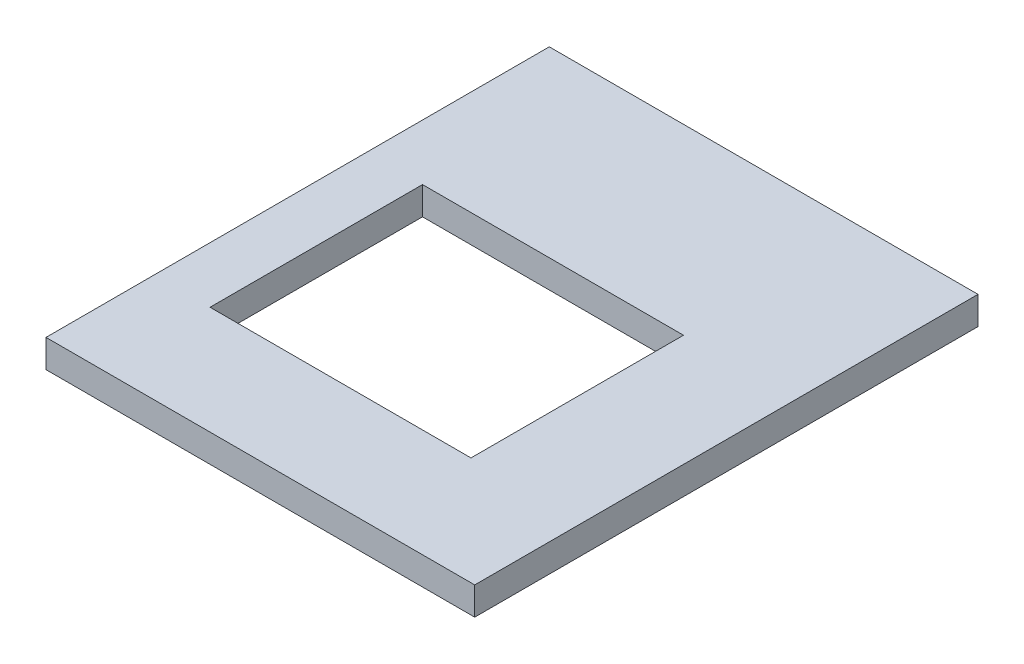
ISO-10303-21;
HEADER;
FILE_DESCRIPTION(('STEP AP214'),'2;1');
FILE_NAME('part.step','',(''),(''),'','','');
FILE_SCHEMA(('AUTOMOTIVE_DESIGN { 1 0 10303 214 1 1 1 1 }'));
ENDSEC;
DATA;
#1=APPLICATION_CONTEXT('core data for automotive mechanical design processes');
#2=APPLICATION_PROTOCOL_DEFINITION('international standard','automotive_design',2000,#1);
#3=PRODUCT_CONTEXT('',#1,'mechanical');
#4=PRODUCT('Part','Part','',(#3));
#5=PRODUCT_RELATED_PRODUCT_CATEGORY('part','',(#4));
#6=PRODUCT_DEFINITION_FORMATION('','',#4);
#7=PRODUCT_DEFINITION_CONTEXT('part definition',#1,'design');
#8=PRODUCT_DEFINITION('design','',#6,#7);
#9=PRODUCT_DEFINITION_SHAPE('','',#8);
#10=(LENGTH_UNIT() NAMED_UNIT(*) SI_UNIT(.MILLI.,.METRE.));
#11=(NAMED_UNIT(*) PLANE_ANGLE_UNIT() SI_UNIT($,.RADIAN.));
#12=(NAMED_UNIT(*) SI_UNIT($,.STERADIAN.) SOLID_ANGLE_UNIT());
#13=UNCERTAINTY_MEASURE_WITH_UNIT(LENGTH_MEASURE(1.E-05),#10,'distance_accuracy_value','');
#14=(GEOMETRIC_REPRESENTATION_CONTEXT(3) GLOBAL_UNCERTAINTY_ASSIGNED_CONTEXT((#13)) GLOBAL_UNIT_ASSIGNED_CONTEXT((#10,
#11,#12)) REPRESENTATION_CONTEXT('',''));
#15=CARTESIAN_POINT('',(0.,0.,0.));
#16=DIRECTION('',(0.,0.,1.));
#17=DIRECTION('',(1.,0.,0.));
#18=AXIS2_PLACEMENT_3D('',#15,#16,#17);
#19=CARTESIAN_POINT('',(0.,0.,2700.));
#20=DIRECTION('',(1.,0.,0.));
#21=DIRECTION('',(0.,0.,-1.));
#22=AXIS2_PLACEMENT_3D('',#19,#20,#21);
#23=PLANE('',#22);
#24=DIRECTION('',(0.,-1.,0.));
#25=VECTOR('',#24,1.);
#26=CARTESIAN_POINT('',(0.,0.,0.));
#27=LINE('',#26,#25);
#28=CARTESIAN_POINT('',(0.,150.,0.));
#29=VERTEX_POINT('',#28);
#30=CARTESIAN_POINT('',(0.,0.,0.));
#31=VERTEX_POINT('',#30);
#32=EDGE_CURVE('E148',#29,#31,#27,.T.);
#33=ORIENTED_EDGE('',*,*,#32,.T.);
#34=DIRECTION('',(0.,0.,-1.));
#35=VECTOR('',#34,1.);
#36=CARTESIAN_POINT('',(0.,0.,2700.));
#37=LINE('',#36,#35);
#38=CARTESIAN_POINT('',(0.,0.,2700.));
#39=VERTEX_POINT('',#38);
#40=EDGE_CURVE('E11',#39,#31,#37,.T.);
#41=ORIENTED_EDGE('',*,*,#40,.F.);
#42=DIRECTION('',(0.,-1.,0.));
#43=VECTOR('',#42,1.);
#44=CARTESIAN_POINT('',(0.,0.,2700.));
#45=LINE('',#44,#43);
#46=CARTESIAN_POINT('',(0.,150.,2700.));
#47=VERTEX_POINT('',#46);
#48=EDGE_CURVE('E154',#47,#39,#45,.T.);
#49=ORIENTED_EDGE('',*,*,#48,.F.);
#50=DIRECTION('',(0.,0.,-1.));
#51=VECTOR('',#50,1.);
#52=CARTESIAN_POINT('',(0.,150.,2700.));
#53=LINE('',#52,#51);
#54=EDGE_CURVE('E168',#47,#29,#53,.T.);
#55=ORIENTED_EDGE('',*,*,#54,.T.);
#56=EDGE_LOOP('',(#33,#41,#49,#55));
#57=FACE_BOUND('',#56,.T.);
#58=ADVANCED_FACE('F40',(#57),#23,.F.);
#59=CARTESIAN_POINT('',(0.,0.,2700.));
#60=DIRECTION('',(0.,1.,0.));
#61=DIRECTION('',(0.,0.,1.));
#62=AXIS2_PLACEMENT_3D('',#59,#60,#61);
#63=PLANE('',#62);
#64=DIRECTION('',(-1.,0.,0.));
#65=VECTOR('',#64,1.);
#66=CARTESIAN_POINT('',(300.,0.,980.));
#67=LINE('',#66,#65);
#68=CARTESIAN_POINT('',(1700.,0.,980.));
#69=VERTEX_POINT('',#68);
#70=CARTESIAN_POINT('',(300.,0.,980.));
#71=VERTEX_POINT('',#70);
#72=EDGE_CURVE('E114',#69,#71,#67,.T.);
#73=ORIENTED_EDGE('',*,*,#72,.T.);
#74=DIRECTION('',(0.,0.,1.));
#75=VECTOR('',#74,1.);
#76=CARTESIAN_POINT('',(300.,0.,980.));
#77=LINE('',#76,#75);
#78=CARTESIAN_POINT('',(300.,0.,2120.));
#79=VERTEX_POINT('',#78);
#80=EDGE_CURVE('E107',#71,#79,#77,.T.);
#81=ORIENTED_EDGE('',*,*,#80,.T.);
#82=DIRECTION('',(1.,0.,0.));
#83=VECTOR('',#82,1.);
#84=CARTESIAN_POINT('',(300.,0.,2120.));
#85=LINE('',#84,#83);
#86=CARTESIAN_POINT('',(1700.,0.,2120.));
#87=VERTEX_POINT('',#86);
#88=EDGE_CURVE('E117',#79,#87,#85,.T.);
#89=ORIENTED_EDGE('',*,*,#88,.T.);
#90=DIRECTION('',(0.,0.,-1.));
#91=VECTOR('',#90,1.);
#92=CARTESIAN_POINT('',(1700.,0.,980.));
#93=LINE('',#92,#91);
#94=EDGE_CURVE('E55',#87,#69,#93,.T.);
#95=ORIENTED_EDGE('',*,*,#94,.T.);
#96=EDGE_LOOP('',(#73,#81,#89,#95));
#97=FACE_BOUND('',#96,.T.);
#98=DIRECTION('',(1.,0.,0.));
#99=VECTOR('',#98,1.);
#100=CARTESIAN_POINT('',(0.,0.,0.));
#101=LINE('',#100,#99);
#102=CARTESIAN_POINT('',(2300.,0.,0.));
#103=VERTEX_POINT('',#102);
#104=EDGE_CURVE('E172',#31,#103,#101,.T.);
#105=ORIENTED_EDGE('',*,*,#104,.T.);
#106=DIRECTION('',(0.,0.,-1.));
#107=VECTOR('',#106,1.);
#108=CARTESIAN_POINT('',(2300.,0.,2700.));
#109=LINE('',#108,#107);
#110=CARTESIAN_POINT('',(2300.,0.,2700.));
#111=VERTEX_POINT('',#110);
#112=EDGE_CURVE('E48',#111,#103,#109,.T.);
#113=ORIENTED_EDGE('',*,*,#112,.F.);
#114=DIRECTION('',(1.,0.,0.));
#115=VECTOR('',#114,1.);
#116=CARTESIAN_POINT('',(0.,0.,2700.));
#117=LINE('',#116,#115);
#118=EDGE_CURVE('E158',#39,#111,#117,.T.);
#119=ORIENTED_EDGE('',*,*,#118,.F.);
#120=ORIENTED_EDGE('',*,*,#40,.T.);
#121=EDGE_LOOP('',(#105,#113,#119,#120));
#122=FACE_BOUND('',#121,.T.);
#123=ADVANCED_FACE('F122',(#97,#122),#63,.F.);
#124=CARTESIAN_POINT('',(2300.,0.,2700.));
#125=DIRECTION('',(-1.,0.,0.));
#126=DIRECTION('',(0.,0.,1.));
#127=AXIS2_PLACEMENT_3D('',#124,#125,#126);
#128=PLANE('',#127);
#129=DIRECTION('',(0.,1.,0.));
#130=VECTOR('',#129,1.);
#131=CARTESIAN_POINT('',(2300.,0.,0.));
#132=LINE('',#131,#130);
#133=CARTESIAN_POINT('',(2300.,150.,0.));
#134=VERTEX_POINT('',#133);
#135=EDGE_CURVE('E175',#103,#134,#132,.T.);
#136=ORIENTED_EDGE('',*,*,#135,.T.);
#137=DIRECTION('',(0.,0.,-1.));
#138=VECTOR('',#137,1.);
#139=CARTESIAN_POINT('',(2300.,150.,2700.));
#140=LINE('',#139,#138);
#141=CARTESIAN_POINT('',(2300.,150.,2700.));
#142=VERTEX_POINT('',#141);
#143=EDGE_CURVE('E183',#142,#134,#140,.T.);
#144=ORIENTED_EDGE('',*,*,#143,.F.);
#145=DIRECTION('',(0.,1.,0.));
#146=VECTOR('',#145,1.);
#147=CARTESIAN_POINT('',(2300.,0.,2700.));
#148=LINE('',#147,#146);
#149=EDGE_CURVE('E162',#111,#142,#148,.T.);
#150=ORIENTED_EDGE('',*,*,#149,.F.);
#151=ORIENTED_EDGE('',*,*,#112,.T.);
#152=EDGE_LOOP('',(#136,#144,#150,#151));
#153=FACE_BOUND('',#152,.T.);
#154=ADVANCED_FACE('F192',(#153),#128,.F.);
#155=CARTESIAN_POINT('',(0.,150.,2700.));
#156=DIRECTION('',(0.,-1.,0.));
#157=DIRECTION('',(0.,0.,-1.));
#158=AXIS2_PLACEMENT_3D('',#155,#156,#157);
#159=PLANE('',#158);
#160=DIRECTION('',(1.,0.,0.));
#161=VECTOR('',#160,1.);
#162=CARTESIAN_POINT('',(300.,150.,2120.));
#163=LINE('',#162,#161);
#164=CARTESIAN_POINT('',(300.,150.,2120.));
#165=VERTEX_POINT('',#164);
#166=CARTESIAN_POINT('',(1700.,150.,2120.));
#167=VERTEX_POINT('',#166);
#168=EDGE_CURVE('E139',#165,#167,#163,.T.);
#169=ORIENTED_EDGE('',*,*,#168,.F.);
#170=DIRECTION('',(0.,0.,1.));
#171=VECTOR('',#170,1.);
#172=CARTESIAN_POINT('',(300.,150.,980.));
#173=LINE('',#172,#171);
#174=CARTESIAN_POINT('',(300.,150.,980.));
#175=VERTEX_POINT('',#174);
#176=EDGE_CURVE('E63',#175,#165,#173,.T.);
#177=ORIENTED_EDGE('',*,*,#176,.F.);
#178=DIRECTION('',(-1.,0.,0.));
#179=VECTOR('',#178,1.);
#180=CARTESIAN_POINT('',(300.,150.,980.));
#181=LINE('',#180,#179);
#182=CARTESIAN_POINT('',(1700.,150.,980.));
#183=VERTEX_POINT('',#182);
#184=EDGE_CURVE('E126',#183,#175,#181,.T.);
#185=ORIENTED_EDGE('',*,*,#184,.F.);
#186=DIRECTION('',(0.,0.,-1.));
#187=VECTOR('',#186,1.);
#188=CARTESIAN_POINT('',(1700.,150.,980.));
#189=LINE('',#188,#187);
#190=EDGE_CURVE('E130',#167,#183,#189,.T.);
#191=ORIENTED_EDGE('',*,*,#190,.F.);
#192=EDGE_LOOP('',(#169,#177,#185,#191));
#193=FACE_BOUND('',#192,.T.);
#194=DIRECTION('',(-1.,0.,0.));
#195=VECTOR('',#194,1.);
#196=CARTESIAN_POINT('',(0.,150.,0.));
#197=LINE('',#196,#195);
#198=EDGE_CURVE('E159',#134,#29,#197,.T.);
#199=ORIENTED_EDGE('',*,*,#198,.T.);
#200=ORIENTED_EDGE('',*,*,#54,.F.);
#201=DIRECTION('',(-1.,0.,0.));
#202=VECTOR('',#201,1.);
#203=CARTESIAN_POINT('',(0.,150.,2700.));
#204=LINE('',#203,#202);
#205=EDGE_CURVE('E165',#142,#47,#204,.T.);
#206=ORIENTED_EDGE('',*,*,#205,.F.);
#207=ORIENTED_EDGE('',*,*,#143,.T.);
#208=EDGE_LOOP('',(#199,#200,#206,#207));
#209=FACE_BOUND('',#208,.T.);
#210=ADVANCED_FACE('F200',(#193,#209),#159,.F.);
#211=CARTESIAN_POINT('',(0.,0.,2700.));
#212=DIRECTION('',(0.,0.,-1.));
#213=DIRECTION('',(-1.,0.,0.));
#214=AXIS2_PLACEMENT_3D('',#211,#212,#213);
#215=PLANE('',#214);
#216=ORIENTED_EDGE('',*,*,#48,.T.);
#217=ORIENTED_EDGE('',*,*,#118,.T.);
#218=ORIENTED_EDGE('',*,*,#149,.T.);
#219=ORIENTED_EDGE('',*,*,#205,.T.);
#220=EDGE_LOOP('',(#216,#217,#218,#219));
#221=FACE_BOUND('',#220,.T.);
#222=ADVANCED_FACE('F206',(#221),#215,.F.);
#223=CARTESIAN_POINT('',(0.,0.,0.));
#224=DIRECTION('',(0.,0.,-1.));
#225=DIRECTION('',(-1.,0.,0.));
#226=AXIS2_PLACEMENT_3D('',#223,#224,#225);
#227=PLANE('',#226);
#228=ORIENTED_EDGE('',*,*,#32,.F.);
#229=ORIENTED_EDGE('',*,*,#198,.F.);
#230=ORIENTED_EDGE('',*,*,#135,.F.);
#231=ORIENTED_EDGE('',*,*,#104,.F.);
#232=EDGE_LOOP('',(#228,#229,#230,#231));
#233=FACE_BOUND('',#232,.T.);
#234=ADVANCED_FACE('F197',(#233),#227,.T.);
#235=CARTESIAN_POINT('',(300.,0.,980.));
#236=DIRECTION('',(-1.,0.,0.));
#237=DIRECTION('',(0.,0.,1.));
#238=AXIS2_PLACEMENT_3D('',#235,#236,#237);
#239=PLANE('',#238);
#240=ORIENTED_EDGE('',*,*,#176,.T.);
#241=DIRECTION('',(0.,1.,0.));
#242=VECTOR('',#241,1.);
#243=CARTESIAN_POINT('',(300.,0.,2120.));
#244=LINE('',#243,#242);
#245=EDGE_CURVE('E103',#79,#165,#244,.T.);
#246=ORIENTED_EDGE('',*,*,#245,.F.);
#247=ORIENTED_EDGE('',*,*,#80,.F.);
#248=DIRECTION('',(0.,1.,0.));
#249=VECTOR('',#248,1.);
#250=CARTESIAN_POINT('',(300.,0.,980.));
#251=LINE('',#250,#249);
#252=EDGE_CURVE('E145',#71,#175,#251,.T.);
#253=ORIENTED_EDGE('',*,*,#252,.T.);
#254=EDGE_LOOP('',(#240,#246,#247,#253));
#255=FACE_BOUND('',#254,.T.);
#256=ADVANCED_FACE('F105',(#255),#239,.F.);
#257=CARTESIAN_POINT('',(300.,0.,980.));
#258=DIRECTION('',(0.,0.,-1.));
#259=DIRECTION('',(-1.,0.,0.));
#260=AXIS2_PLACEMENT_3D('',#257,#258,#259);
#261=PLANE('',#260);
#262=ORIENTED_EDGE('',*,*,#184,.T.);
#263=ORIENTED_EDGE('',*,*,#252,.F.);
#264=ORIENTED_EDGE('',*,*,#72,.F.);
#265=DIRECTION('',(0.,1.,0.));
#266=VECTOR('',#265,1.);
#267=CARTESIAN_POINT('',(1700.,0.,980.));
#268=LINE('',#267,#266);
#269=EDGE_CURVE('E149',#69,#183,#268,.T.);
#270=ORIENTED_EDGE('',*,*,#269,.T.);
#271=EDGE_LOOP('',(#262,#263,#264,#270));
#272=FACE_BOUND('',#271,.T.);
#273=ADVANCED_FACE('F223',(#272),#261,.F.);
#274=CARTESIAN_POINT('',(1700.,0.,980.));
#275=DIRECTION('',(1.,0.,0.));
#276=DIRECTION('',(0.,0.,-1.));
#277=AXIS2_PLACEMENT_3D('',#274,#275,#276);
#278=PLANE('',#277);
#279=ORIENTED_EDGE('',*,*,#190,.T.);
#280=ORIENTED_EDGE('',*,*,#269,.F.);
#281=ORIENTED_EDGE('',*,*,#94,.F.);
#282=DIRECTION('',(0.,1.,0.));
#283=VECTOR('',#282,1.);
#284=CARTESIAN_POINT('',(1700.,0.,2120.));
#285=LINE('',#284,#283);
#286=EDGE_CURVE('E113',#87,#167,#285,.T.);
#287=ORIENTED_EDGE('',*,*,#286,.T.);
#288=EDGE_LOOP('',(#279,#280,#281,#287));
#289=FACE_BOUND('',#288,.T.);
#290=ADVANCED_FACE('F226',(#289),#278,.F.);
#291=CARTESIAN_POINT('',(300.,0.,2120.));
#292=DIRECTION('',(0.,0.,1.));
#293=DIRECTION('',(1.,0.,0.));
#294=AXIS2_PLACEMENT_3D('',#291,#292,#293);
#295=PLANE('',#294);
#296=ORIENTED_EDGE('',*,*,#168,.T.);
#297=ORIENTED_EDGE('',*,*,#286,.F.);
#298=ORIENTED_EDGE('',*,*,#88,.F.);
#299=ORIENTED_EDGE('',*,*,#245,.T.);
#300=EDGE_LOOP('',(#296,#297,#298,#299));
#301=FACE_BOUND('',#300,.T.);
#302=ADVANCED_FACE('F118',(#301),#295,.F.);
#303=CLOSED_SHELL('',(#58,#123,#154,#210,#222,#234,#256,#273,#290,#302));
#304=MANIFOLD_SOLID_BREP('B2',#303);
#305=ADVANCED_BREP_SHAPE_REPRESENTATION('',(#18,#304),#14);
#306=SHAPE_DEFINITION_REPRESENTATION(#9,#305);
ENDSEC;
END-ISO-10303-21;
